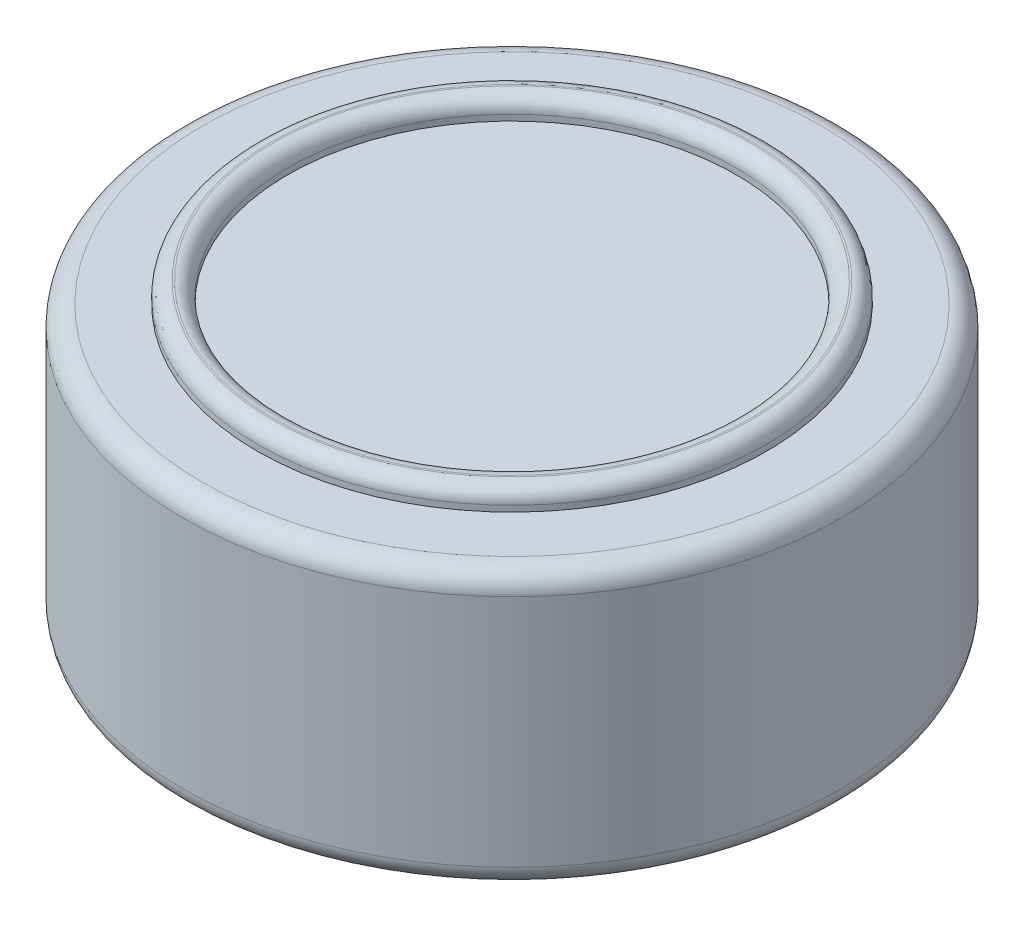
ISO-10303-21;
HEADER;
FILE_DESCRIPTION(('STEP AP214'),'2;1');
FILE_NAME('part.step','',(''),(''),'','','');
FILE_SCHEMA(('AUTOMOTIVE_DESIGN { 1 0 10303 214 1 1 1 1 }'));
ENDSEC;
DATA;
#1=APPLICATION_CONTEXT('core data for automotive mechanical design processes');
#2=APPLICATION_PROTOCOL_DEFINITION('international standard','automotive_design',2000,#1);
#3=PRODUCT_CONTEXT('',#1,'mechanical');
#4=PRODUCT('Part','Part','',(#3));
#5=PRODUCT_RELATED_PRODUCT_CATEGORY('part','',(#4));
#6=PRODUCT_DEFINITION_FORMATION('','',#4);
#7=PRODUCT_DEFINITION_CONTEXT('part definition',#1,'design');
#8=PRODUCT_DEFINITION('design','',#6,#7);
#9=PRODUCT_DEFINITION_SHAPE('','',#8);
#10=(LENGTH_UNIT() NAMED_UNIT(*) SI_UNIT(.MILLI.,.METRE.));
#11=(NAMED_UNIT(*) PLANE_ANGLE_UNIT() SI_UNIT($,.RADIAN.));
#12=(NAMED_UNIT(*) SI_UNIT($,.STERADIAN.) SOLID_ANGLE_UNIT());
#13=UNCERTAINTY_MEASURE_WITH_UNIT(LENGTH_MEASURE(1.E-05),#10,'distance_accuracy_value','');
#14=(GEOMETRIC_REPRESENTATION_CONTEXT(3) GLOBAL_UNCERTAINTY_ASSIGNED_CONTEXT((#13)) GLOBAL_UNIT_ASSIGNED_CONTEXT((#10,
#11,#12)) REPRESENTATION_CONTEXT('',''));
#15=CARTESIAN_POINT('',(0.,0.,0.));
#16=DIRECTION('',(0.,0.,1.));
#17=DIRECTION('',(1.,0.,0.));
#18=AXIS2_PLACEMENT_3D('',#15,#16,#17);
#19=CARTESIAN_POINT('',(0.,13.5,0.));
#20=DIRECTION('',(0.,-1.,0.));
#21=DIRECTION('',(0.,0.,-1.));
#22=AXIS2_PLACEMENT_3D('',#19,#20,#21);
#23=CYLINDRICAL_SURFACE('',#22,16.1655);
#24=CARTESIAN_POINT('',(0.,0.999999999999999,0.));
#25=DIRECTION('',(0.,1.,0.));
#26=DIRECTION('',(0.,0.,1.));
#27=AXIS2_PLACEMENT_3D('',#24,#25,#26);
#28=CIRCLE('',#27,16.1655);
#29=CARTESIAN_POINT('',(0.,0.999999999999999,16.1655));
#30=VERTEX_POINT('',#29);
#31=EDGE_CURVE('E73',#30,#30,#28,.T.);
#32=ORIENTED_EDGE('',*,*,#31,.T.);
#33=EDGE_LOOP('',(#32));
#34=FACE_BOUND('',#33,.T.);
#35=CARTESIAN_POINT('',(0.,12.5,0.));
#36=DIRECTION('',(0.,1.,0.));
#37=DIRECTION('',(0.,0.,1.));
#38=AXIS2_PLACEMENT_3D('',#35,#36,#37);
#39=CIRCLE('',#38,16.1655);
#40=CARTESIAN_POINT('',(0.,12.5,16.1655));
#41=VERTEX_POINT('',#40);
#42=EDGE_CURVE('E76',#41,#41,#39,.F.);
#43=ORIENTED_EDGE('',*,*,#42,.T.);
#44=EDGE_LOOP('',(#43));
#45=FACE_BOUND('',#44,.T.);
#46=ADVANCED_FACE('F44',(#34,#45),#23,.T.);
#47=CARTESIAN_POINT('',(0.,13.5,0.));
#48=DIRECTION('',(0.,1.,0.));
#49=DIRECTION('',(0.,0.,1.));
#50=AXIS2_PLACEMENT_3D('',#47,#48,#49);
#51=PLANE('',#50);
#52=CARTESIAN_POINT('',(0.,13.5,0.));
#53=DIRECTION('',(0.,1.,0.));
#54=DIRECTION('',(0.,0.,1.));
#55=AXIS2_PLACEMENT_3D('',#52,#53,#54);
#56=CIRCLE('',#55,12.5);
#57=CARTESIAN_POINT('',(0.,13.5,12.5));
#58=VERTEX_POINT('',#57);
#59=EDGE_CURVE('E79',#58,#58,#56,.T.);
#60=ORIENTED_EDGE('',*,*,#59,.F.);
#61=EDGE_LOOP('',(#60));
#62=FACE_BOUND('',#61,.T.);
#63=CARTESIAN_POINT('',(0.,13.5,0.));
#64=DIRECTION('',(0.,1.,0.));
#65=DIRECTION('',(0.,0.,1.));
#66=AXIS2_PLACEMENT_3D('',#63,#64,#65);
#67=CIRCLE('',#66,15.1655);
#68=CARTESIAN_POINT('',(0.,13.5,15.1655));
#69=VERTEX_POINT('',#68);
#70=EDGE_CURVE('E67',#69,#69,#67,.T.);
#71=ORIENTED_EDGE('',*,*,#70,.T.);
#72=EDGE_LOOP('',(#71));
#73=FACE_BOUND('',#72,.T.);
#74=ADVANCED_FACE('F85',(#62,#73),#51,.T.);
#75=CARTESIAN_POINT('',(0.,0.,0.));
#76=DIRECTION('',(0.,1.,0.));
#77=DIRECTION('',(0.,0.,1.));
#78=AXIS2_PLACEMENT_3D('',#75,#76,#77);
#79=PLANE('',#78);
#80=CARTESIAN_POINT('',(0.,0.,0.));
#81=DIRECTION('',(0.,1.,0.));
#82=DIRECTION('',(0.,0.,1.));
#83=AXIS2_PLACEMENT_3D('',#80,#81,#82);
#84=CIRCLE('',#83,15.1655);
#85=CARTESIAN_POINT('',(0.,0.,15.1655));
#86=VERTEX_POINT('',#85);
#87=EDGE_CURVE('E70',#86,#86,#84,.F.);
#88=ORIENTED_EDGE('',*,*,#87,.T.);
#89=EDGE_LOOP('',(#88));
#90=FACE_BOUND('',#89,.T.);
#91=ADVANCED_FACE('F88',(#90),#79,.F.);
#92=CARTESIAN_POINT('',(0.,0.999999999999999,0.));
#93=DIRECTION('',(0.,1.,0.));
#94=DIRECTION('',(0.,0.,1.));
#95=AXIS2_PLACEMENT_3D('',#92,#93,#94);
#96=TOROIDAL_SURFACE('',#95,15.1655,1.);
#97=ORIENTED_EDGE('',*,*,#87,.F.);
#98=EDGE_LOOP('',(#97));
#99=FACE_BOUND('',#98,.T.);
#100=ORIENTED_EDGE('',*,*,#31,.F.);
#101=EDGE_LOOP('',(#100));
#102=FACE_BOUND('',#101,.T.);
#103=ADVANCED_FACE('F96',(#99,#102),#96,.T.);
#104=CARTESIAN_POINT('',(0.,12.5,0.));
#105=DIRECTION('',(0.,1.,0.));
#106=DIRECTION('',(0.,0.,1.));
#107=AXIS2_PLACEMENT_3D('',#104,#105,#106);
#108=TOROIDAL_SURFACE('',#107,15.1655,1.);
#109=ORIENTED_EDGE('',*,*,#42,.F.);
#110=EDGE_LOOP('',(#109));
#111=FACE_BOUND('',#110,.T.);
#112=ORIENTED_EDGE('',*,*,#70,.F.);
#113=EDGE_LOOP('',(#112));
#114=FACE_BOUND('',#113,.T.);
#115=ADVANCED_FACE('F93',(#111,#114),#108,.T.);
#116=CARTESIAN_POINT('',(0.,14.5,0.));
#117=DIRECTION('',(0.,1.,0.));
#118=DIRECTION('',(0.,0.,1.));
#119=AXIS2_PLACEMENT_3D('',#116,#117,#118);
#120=PLANE('',#119);
#121=CARTESIAN_POINT('',(0.,14.5,0.));
#122=DIRECTION('',(0.,1.,0.));
#123=DIRECTION('',(0.,0.,1.));
#124=AXIS2_PLACEMENT_3D('',#121,#122,#123);
#125=CIRCLE('',#124,11.707);
#126=CARTESIAN_POINT('',(0.,14.5,11.707));
#127=VERTEX_POINT('',#126);
#128=EDGE_CURVE('E51',#127,#127,#125,.F.);
#129=ORIENTED_EDGE('',*,*,#128,.T.);
#130=EDGE_LOOP('',(#129));
#131=FACE_BOUND('',#130,.T.);
#132=CARTESIAN_POINT('',(0.,14.5,0.));
#133=DIRECTION('',(0.,1.,0.));
#134=DIRECTION('',(0.,0.,1.));
#135=AXIS2_PLACEMENT_3D('',#132,#133,#134);
#136=CIRCLE('',#135,11.793);
#137=CARTESIAN_POINT('',(0.,14.5,11.793));
#138=VERTEX_POINT('',#137);
#139=EDGE_CURVE('E55',#138,#138,#136,.T.);
#140=ORIENTED_EDGE('',*,*,#139,.T.);
#141=EDGE_LOOP('',(#140));
#142=FACE_BOUND('',#141,.T.);
#143=ADVANCED_FACE('F95',(#131,#142),#120,.T.);
#144=CARTESIAN_POINT('',(0.,14.5,0.));
#145=DIRECTION('',(0.,-1.,0.));
#146=DIRECTION('',(0.,0.,-1.));
#147=AXIS2_PLACEMENT_3D('',#144,#145,#146);
#148=CYLINDRICAL_SURFACE('',#147,12.5);
#149=CARTESIAN_POINT('',(0.,13.793,0.));
#150=DIRECTION('',(0.,1.,0.));
#151=DIRECTION('',(0.,0.,1.));
#152=AXIS2_PLACEMENT_3D('',#149,#150,#151);
#153=CIRCLE('',#152,12.5);
#154=CARTESIAN_POINT('',(0.,13.793,12.5));
#155=VERTEX_POINT('',#154);
#156=EDGE_CURVE('E12',#155,#155,#153,.F.);
#157=ORIENTED_EDGE('',*,*,#156,.T.);
#158=EDGE_LOOP('',(#157));
#159=FACE_BOUND('',#158,.T.);
#160=ORIENTED_EDGE('',*,*,#59,.T.);
#161=EDGE_LOOP('',(#160));
#162=FACE_BOUND('',#161,.T.);
#163=ADVANCED_FACE('F83',(#159,#162),#148,.T.);
#164=CARTESIAN_POINT('',(0.,14.5,0.));
#165=DIRECTION('',(0.,-1.,0.));
#166=DIRECTION('',(0.,0.,-1.));
#167=AXIS2_PLACEMENT_3D('',#164,#165,#166);
#168=CYLINDRICAL_SURFACE('',#167,11.);
#169=CARTESIAN_POINT('',(0.,13.793,0.));
#170=DIRECTION('',(0.,1.,0.));
#171=DIRECTION('',(0.,0.,1.));
#172=AXIS2_PLACEMENT_3D('',#169,#170,#171);
#173=CIRCLE('',#172,11.);
#174=CARTESIAN_POINT('',(0.,13.793,11.));
#175=VERTEX_POINT('',#174);
#176=EDGE_CURVE('E59',#175,#175,#173,.T.);
#177=ORIENTED_EDGE('',*,*,#176,.T.);
#178=EDGE_LOOP('',(#177));
#179=FACE_BOUND('',#178,.T.);
#180=CARTESIAN_POINT('',(0.,13.5,0.));
#181=DIRECTION('',(0.,1.,0.));
#182=DIRECTION('',(0.,0.,1.));
#183=AXIS2_PLACEMENT_3D('',#180,#181,#182);
#184=CIRCLE('',#183,11.);
#185=CARTESIAN_POINT('',(0.,13.5,11.));
#186=VERTEX_POINT('',#185);
#187=EDGE_CURVE('E64',#186,#186,#184,.F.);
#188=ORIENTED_EDGE('',*,*,#187,.T.);
#189=EDGE_LOOP('',(#188));
#190=FACE_BOUND('',#189,.T.);
#191=ADVANCED_FACE('F118',(#179,#190),#168,.F.);
#192=ORIENTED_EDGE('',*,*,#187,.F.);
#193=EDGE_LOOP('',(#192));
#194=FACE_BOUND('',#193,.T.);
#195=ADVANCED_FACE('F90',(#194),#51,.T.);
#196=CARTESIAN_POINT('',(0.,13.793,0.));
#197=DIRECTION('',(0.,1.,0.));
#198=DIRECTION('',(0.,0.,1.));
#199=AXIS2_PLACEMENT_3D('',#196,#197,#198);
#200=TOROIDAL_SURFACE('',#199,11.707,0.707);
#201=ORIENTED_EDGE('',*,*,#128,.F.);
#202=EDGE_LOOP('',(#201));
#203=FACE_BOUND('',#202,.T.);
#204=ORIENTED_EDGE('',*,*,#176,.F.);
#205=EDGE_LOOP('',(#204));
#206=FACE_BOUND('',#205,.T.);
#207=ADVANCED_FACE('F125',(#203,#206),#200,.T.);
#208=CARTESIAN_POINT('',(0.,13.793,0.));
#209=DIRECTION('',(0.,1.,0.));
#210=DIRECTION('',(0.,0.,1.));
#211=AXIS2_PLACEMENT_3D('',#208,#209,#210);
#212=TOROIDAL_SURFACE('',#211,11.793,0.707);
#213=ORIENTED_EDGE('',*,*,#156,.F.);
#214=EDGE_LOOP('',(#213));
#215=FACE_BOUND('',#214,.T.);
#216=ORIENTED_EDGE('',*,*,#139,.F.);
#217=EDGE_LOOP('',(#216));
#218=FACE_BOUND('',#217,.T.);
#219=ADVANCED_FACE('F46',(#215,#218),#212,.T.);
#220=CLOSED_SHELL('',(#46,#74,#91,#103,#115,#143,#163,#191,#195,#207,#219));
#221=MANIFOLD_SOLID_BREP('B2',#220);
#222=ADVANCED_BREP_SHAPE_REPRESENTATION('',(#18,#221),#14);
#223=SHAPE_DEFINITION_REPRESENTATION(#9,#222);
ENDSEC;
END-ISO-10303-21;
